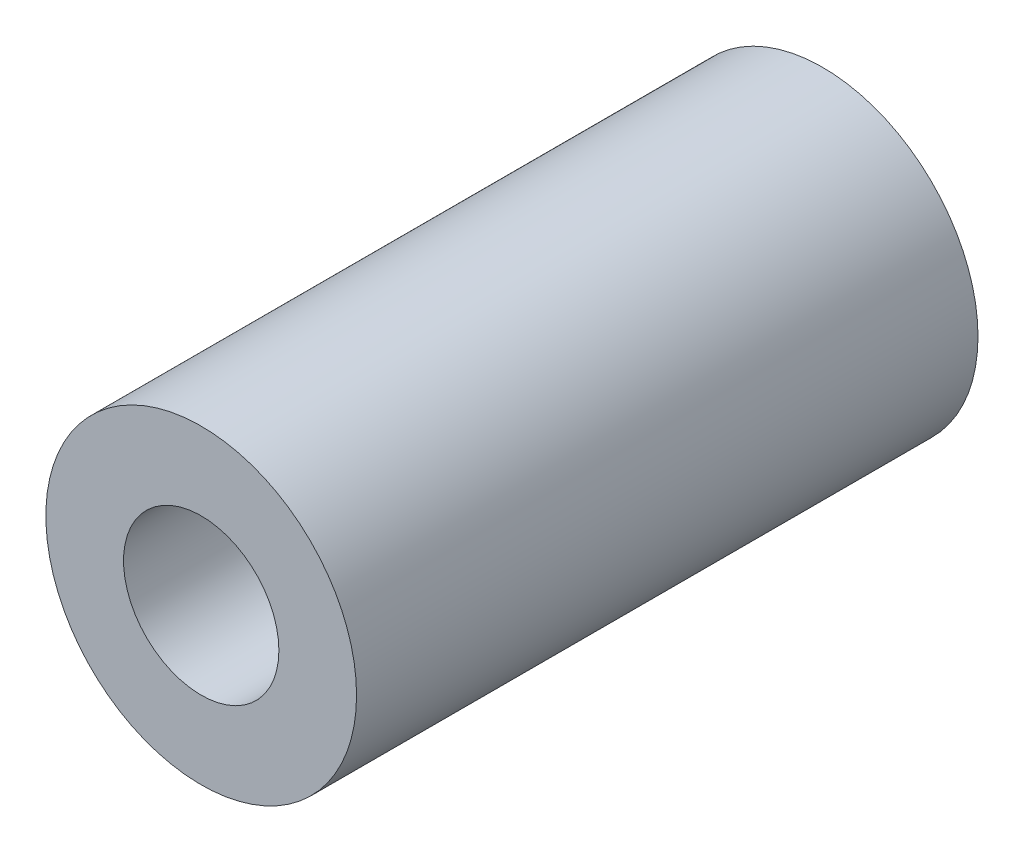
ISO-10303-21;
HEADER;
FILE_DESCRIPTION(('STEP AP214'),'2;1');
FILE_NAME('part.step','',(''),(''),'','','');
FILE_SCHEMA(('AUTOMOTIVE_DESIGN { 1 0 10303 214 1 1 1 1 }'));
ENDSEC;
DATA;
#1=APPLICATION_CONTEXT('core data for automotive mechanical design processes');
#2=APPLICATION_PROTOCOL_DEFINITION('international standard','automotive_design',2000,#1);
#3=PRODUCT_CONTEXT('',#1,'mechanical');
#4=PRODUCT('Part','Part','',(#3));
#5=PRODUCT_RELATED_PRODUCT_CATEGORY('part','',(#4));
#6=PRODUCT_DEFINITION_FORMATION('','',#4);
#7=PRODUCT_DEFINITION_CONTEXT('part definition',#1,'design');
#8=PRODUCT_DEFINITION('design','',#6,#7);
#9=PRODUCT_DEFINITION_SHAPE('','',#8);
#10=(LENGTH_UNIT() NAMED_UNIT(*) SI_UNIT(.MILLI.,.METRE.));
#11=(NAMED_UNIT(*) PLANE_ANGLE_UNIT() SI_UNIT($,.RADIAN.));
#12=(NAMED_UNIT(*) SI_UNIT($,.STERADIAN.) SOLID_ANGLE_UNIT());
#13=UNCERTAINTY_MEASURE_WITH_UNIT(LENGTH_MEASURE(1.E-05),#10,'distance_accuracy_value','');
#14=(GEOMETRIC_REPRESENTATION_CONTEXT(3) GLOBAL_UNCERTAINTY_ASSIGNED_CONTEXT((#13)) GLOBAL_UNIT_ASSIGNED_CONTEXT((#10,
#11,#12)) REPRESENTATION_CONTEXT('',''));
#15=CARTESIAN_POINT('',(0.,0.,0.));
#16=DIRECTION('',(0.,0.,1.));
#17=DIRECTION('',(1.,0.,0.));
#18=AXIS2_PLACEMENT_3D('',#15,#16,#17);
#19=CARTESIAN_POINT('',(0.,0.,-40.));
#20=DIRECTION('',(0.,0.,1.));
#21=DIRECTION('',(1.,0.,0.));
#22=AXIS2_PLACEMENT_3D('',#19,#20,#21);
#23=CYLINDRICAL_SURFACE('',#22,10.);
#24=CARTESIAN_POINT('',(0.,0.,-40.));
#25=DIRECTION('',(0.,0.,1.));
#26=DIRECTION('',(1.,0.,0.));
#27=AXIS2_PLACEMENT_3D('',#24,#25,#26);
#28=CIRCLE('',#27,10.);
#29=CARTESIAN_POINT('',(10.,0.,-40.));
#30=VERTEX_POINT('',#29);
#31=EDGE_CURVE('E10',#30,#30,#28,.T.);
#32=ORIENTED_EDGE('',*,*,#31,.T.);
#33=EDGE_LOOP('',(#32));
#34=FACE_BOUND('',#33,.T.);
#35=CARTESIAN_POINT('',(0.,0.,0.));
#36=DIRECTION('',(0.,0.,1.));
#37=DIRECTION('',(1.,0.,0.));
#38=AXIS2_PLACEMENT_3D('',#35,#36,#37);
#39=CIRCLE('',#38,10.);
#40=CARTESIAN_POINT('',(10.,0.,0.));
#41=VERTEX_POINT('',#40);
#42=EDGE_CURVE('E37',#41,#41,#39,.T.);
#43=ORIENTED_EDGE('',*,*,#42,.F.);
#44=EDGE_LOOP('',(#43));
#45=FACE_BOUND('',#44,.T.);
#46=ADVANCED_FACE('F34',(#34,#45),#23,.T.);
#47=CARTESIAN_POINT('',(0.,0.,-40.));
#48=DIRECTION('',(0.,0.,1.));
#49=DIRECTION('',(1.,0.,0.));
#50=AXIS2_PLACEMENT_3D('',#47,#48,#49);
#51=PLANE('',#50);
#52=CARTESIAN_POINT('',(0.,0.,-40.));
#53=DIRECTION('',(0.,0.,1.));
#54=DIRECTION('',(1.,0.,0.));
#55=AXIS2_PLACEMENT_3D('',#52,#53,#54);
#56=CIRCLE('',#55,5.);
#57=CARTESIAN_POINT('',(5.,0.,-40.));
#58=VERTEX_POINT('',#57);
#59=EDGE_CURVE('E44',#58,#58,#56,.T.);
#60=ORIENTED_EDGE('',*,*,#59,.T.);
#61=EDGE_LOOP('',(#60));
#62=FACE_BOUND('',#61,.T.);
#63=ORIENTED_EDGE('',*,*,#31,.F.);
#64=EDGE_LOOP('',(#63));
#65=FACE_BOUND('',#64,.T.);
#66=ADVANCED_FACE('F52',(#62,#65),#51,.F.);
#67=CARTESIAN_POINT('',(0.,0.,0.));
#68=DIRECTION('',(0.,0.,1.));
#69=DIRECTION('',(1.,0.,0.));
#70=AXIS2_PLACEMENT_3D('',#67,#68,#69);
#71=PLANE('',#70);
#72=CARTESIAN_POINT('',(0.,0.,0.));
#73=DIRECTION('',(0.,0.,1.));
#74=DIRECTION('',(1.,0.,0.));
#75=AXIS2_PLACEMENT_3D('',#72,#73,#74);
#76=CIRCLE('',#75,5.);
#77=CARTESIAN_POINT('',(5.,0.,0.));
#78=VERTEX_POINT('',#77);
#79=EDGE_CURVE('E46',#78,#78,#76,.T.);
#80=ORIENTED_EDGE('',*,*,#79,.F.);
#81=EDGE_LOOP('',(#80));
#82=FACE_BOUND('',#81,.T.);
#83=ORIENTED_EDGE('',*,*,#42,.T.);
#84=EDGE_LOOP('',(#83));
#85=FACE_BOUND('',#84,.T.);
#86=ADVANCED_FACE('F58',(#82,#85),#71,.T.);
#87=CARTESIAN_POINT('',(0.,0.,-40.));
#88=DIRECTION('',(0.,0.,1.));
#89=DIRECTION('',(1.,0.,0.));
#90=AXIS2_PLACEMENT_3D('',#87,#88,#89);
#91=CYLINDRICAL_SURFACE('',#90,5.);
#92=ORIENTED_EDGE('',*,*,#59,.F.);
#93=EDGE_LOOP('',(#92));
#94=FACE_BOUND('',#93,.T.);
#95=ORIENTED_EDGE('',*,*,#79,.T.);
#96=EDGE_LOOP('',(#95));
#97=FACE_BOUND('',#96,.T.);
#98=ADVANCED_FACE('F55',(#94,#97),#91,.F.);
#99=CLOSED_SHELL('',(#46,#66,#86,#98));
#100=MANIFOLD_SOLID_BREP('B2',#99);
#101=ADVANCED_BREP_SHAPE_REPRESENTATION('',(#18,#100),#14);
#102=SHAPE_DEFINITION_REPRESENTATION(#9,#101);
ENDSEC;
END-ISO-10303-21;
